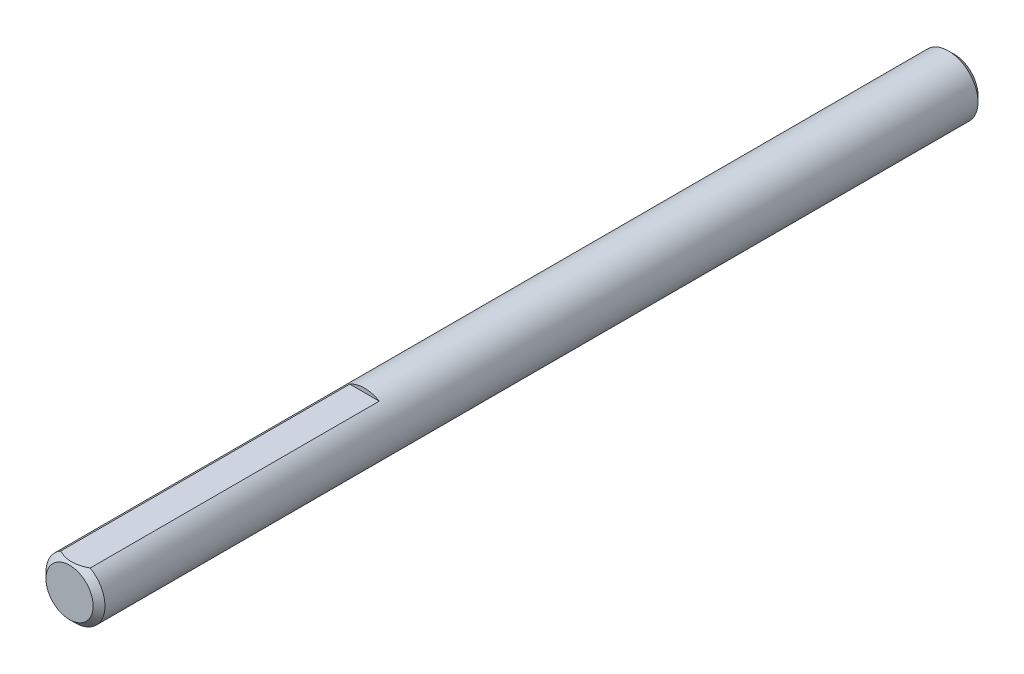
ISO-10303-21;
HEADER;
FILE_DESCRIPTION(('STEP AP214'),'2;1');
FILE_NAME('part.step','',(''),(''),'','','');
FILE_SCHEMA(('AUTOMOTIVE_DESIGN { 1 0 10303 214 1 1 1 1 }'));
ENDSEC;
DATA;
#1=APPLICATION_CONTEXT('core data for automotive mechanical design processes');
#2=APPLICATION_PROTOCOL_DEFINITION('international standard','automotive_design',2000,#1);
#3=PRODUCT_CONTEXT('',#1,'mechanical');
#4=PRODUCT('Part','Part','',(#3));
#5=PRODUCT_RELATED_PRODUCT_CATEGORY('part','',(#4));
#6=PRODUCT_DEFINITION_FORMATION('','',#4);
#7=PRODUCT_DEFINITION_CONTEXT('part definition',#1,'design');
#8=PRODUCT_DEFINITION('design','',#6,#7);
#9=PRODUCT_DEFINITION_SHAPE('','',#8);
#10=(LENGTH_UNIT() NAMED_UNIT(*) SI_UNIT(.MILLI.,.METRE.));
#11=(NAMED_UNIT(*) PLANE_ANGLE_UNIT() SI_UNIT($,.RADIAN.));
#12=(NAMED_UNIT(*) SI_UNIT($,.STERADIAN.) SOLID_ANGLE_UNIT());
#13=UNCERTAINTY_MEASURE_WITH_UNIT(LENGTH_MEASURE(1.E-05),#10,'distance_accuracy_value','');
#14=(GEOMETRIC_REPRESENTATION_CONTEXT(3) GLOBAL_UNCERTAINTY_ASSIGNED_CONTEXT((#13)) GLOBAL_UNIT_ASSIGNED_CONTEXT((#10,
#11,#12)) REPRESENTATION_CONTEXT('',''));
#15=CARTESIAN_POINT('',(0.,0.,0.));
#16=DIRECTION('',(0.,0.,1.));
#17=DIRECTION('',(1.,0.,0.));
#18=AXIS2_PLACEMENT_3D('',#15,#16,#17);
#19=CARTESIAN_POINT('',(0.,0.,38.1));
#20=DIRECTION('',(0.,0.,-1.));
#21=DIRECTION('',(-1.,0.,0.));
#22=AXIS2_PLACEMENT_3D('',#19,#20,#21);
#23=CYLINDRICAL_SURFACE('',#22,2.54);
#24=CARTESIAN_POINT('',(0.,0.,-37.5919999999999));
#25=DIRECTION('',(0.,0.,1.));
#26=DIRECTION('',(1.,0.,0.));
#27=AXIS2_PLACEMENT_3D('',#24,#25,#26);
#28=CIRCLE('',#27,2.54);
#29=CARTESIAN_POINT('',(2.54,0.,-37.5919999999999));
#30=VERTEX_POINT('',#29);
#31=EDGE_CURVE('E77',#30,#30,#28,.T.);
#32=ORIENTED_EDGE('',*,*,#31,.T.);
#33=EDGE_LOOP('',(#32));
#34=FACE_BOUND('',#33,.T.);
#35=DIRECTION('',(0.,0.,-1.));
#36=VECTOR('',#35,1.);
#37=CARTESIAN_POINT('',(1.27,2.19970452561247,38.1));
#38=LINE('',#37,#36);
#39=CARTESIAN_POINT('',(1.27,2.19970452561247,37.592));
#40=VERTEX_POINT('',#39);
#41=CARTESIAN_POINT('',(1.27,2.19970452561247,12.7));
#42=VERTEX_POINT('',#41);
#43=EDGE_CURVE('E65',#40,#42,#38,.T.);
#44=ORIENTED_EDGE('',*,*,#43,.F.);
#45=CARTESIAN_POINT('',(0.,0.,37.592));
#46=DIRECTION('',(0.,0.,1.));
#47=DIRECTION('',(1.,0.,0.));
#48=AXIS2_PLACEMENT_3D('',#45,#46,#47);
#49=CIRCLE('',#48,2.54);
#50=CARTESIAN_POINT('',(-1.27,2.19970452561247,37.592));
#51=VERTEX_POINT('',#50);
#52=EDGE_CURVE('E75',#40,#51,#49,.F.);
#53=ORIENTED_EDGE('',*,*,#52,.T.);
#54=DIRECTION('',(0.,0.,-1.));
#55=VECTOR('',#54,1.);
#56=CARTESIAN_POINT('',(-1.27,2.19970452561247,38.1));
#57=LINE('',#56,#55);
#58=CARTESIAN_POINT('',(-1.27,2.19970452561247,12.7));
#59=VERTEX_POINT('',#58);
#60=EDGE_CURVE('E54',#51,#59,#57,.T.);
#61=ORIENTED_EDGE('',*,*,#60,.T.);
#62=CARTESIAN_POINT('',(0.,0.,12.7));
#63=DIRECTION('',(0.,0.,1.));
#64=DIRECTION('',(1.,0.,0.));
#65=AXIS2_PLACEMENT_3D('',#62,#63,#64);
#66=CIRCLE('',#65,2.54);
#67=EDGE_CURVE('E68',#42,#59,#66,.T.);
#68=ORIENTED_EDGE('',*,*,#67,.F.);
#69=EDGE_LOOP('',(#44,#53,#61,#68));
#70=FACE_BOUND('',#69,.T.);
#71=ADVANCED_FACE('F33',(#34,#70),#23,.T.);
#72=CARTESIAN_POINT('',(0.,0.,38.1));
#73=DIRECTION('',(0.,0.,-1.));
#74=DIRECTION('',(-1.,0.,0.));
#75=AXIS2_PLACEMENT_3D('',#72,#73,#74);
#76=CONICAL_SURFACE('',#75,2.03200000000003,0.785398163397448);
#77=CARTESIAN_POINT('',(0.,0.,38.1));
#78=DIRECTION('',(0.,0.,1.));
#79=DIRECTION('',(1.,0.,0.));
#80=AXIS2_PLACEMENT_3D('',#77,#78,#79);
#81=CIRCLE('',#80,2.03200000000003);
#82=CARTESIAN_POINT('',(2.03200000000003,0.,38.1));
#83=VERTEX_POINT('',#82);
#84=EDGE_CURVE('E47',#83,#83,#81,.T.);
#85=ORIENTED_EDGE('',*,*,#84,.F.);
#86=EDGE_LOOP('',(#85));
#87=FACE_BOUND('',#86,.T.);
#88=ORIENTED_EDGE('',*,*,#52,.F.);
#89=CARTESIAN_POINT('',(-2.58316908178985,2.19970452561247,36.739145375187));
#90=CARTESIAN_POINT('',(-2.52049319640085,2.19970452561247,36.7868532196368));
#91=CARTESIAN_POINT('',(-2.45747207721012,2.19970452561247,36.83411478562));
#92=CARTESIAN_POINT('',(-2.33060104455056,2.19970452561247,36.9275437740947));
#93=CARTESIAN_POINT('',(-2.26675093205037,2.19970452561247,36.9737109260207));
#94=CARTESIAN_POINT('',(-2.13761650282198,2.19970452561247,37.0650780382441));
#95=CARTESIAN_POINT('',(-2.07232491176344,2.19970452561247,37.1102677516298));
#96=CARTESIAN_POINT('',(-1.94064249297732,2.19970452561247,37.1990108114676));
#97=CARTESIAN_POINT('',(-1.87425174247469,2.19970452561247,37.2425642721828));
#98=CARTESIAN_POINT('',(-1.73617158229784,2.19970452561247,37.3302190969326));
#99=CARTESIAN_POINT('',(-1.66440318819355,2.19970452561247,37.3741966682722));
#100=CARTESIAN_POINT('',(-1.51920723742954,2.19970452561247,37.4593175945583));
#101=CARTESIAN_POINT('',(-1.44577990020509,2.19970452561247,37.5004613214679));
#102=CARTESIAN_POINT('',(-1.29723008295145,2.19970452561247,37.5790518440412));
#103=CARTESIAN_POINT('',(-1.22211312737996,2.19970452561247,37.6165090001414));
#104=CARTESIAN_POINT('',(-1.06979765257681,2.19970452561247,37.6868806522726));
#105=CARTESIAN_POINT('',(-0.992600112901668,2.19970452561247,37.7197972428754));
#106=CARTESIAN_POINT('',(-0.842917942085993,2.19970452561247,37.7772451497844));
#107=CARTESIAN_POINT('',(-0.770621140470917,2.19970452561247,37.8022608351786));
#108=CARTESIAN_POINT('',(-0.624242988128888,2.19970452561247,37.8464985498804));
#109=CARTESIAN_POINT('',(-0.550161519023574,2.19970452561247,37.8657201937157));
#110=CARTESIAN_POINT('',(-0.401913145026286,2.19970452561247,37.8970306326729));
#111=CARTESIAN_POINT('',(-0.327773156117409,2.19970452561247,37.9092447637992));
#112=CARTESIAN_POINT('',(-0.178645064548218,2.19970452561247,37.9262950736235));
#113=CARTESIAN_POINT('',(-0.1036571227499,2.19970452561247,37.9311326288113));
#114=CARTESIAN_POINT('',(0.0434686047213363,2.19970452561247,37.9330475881988));
#115=CARTESIAN_POINT('',(0.115602594041888,2.19970452561247,37.9304224689823));
#116=CARTESIAN_POINT('',(0.259276434858723,2.19970452561247,37.9182254175711));
#117=CARTESIAN_POINT('',(0.330816229517487,2.19970452561247,37.9086528283852));
#118=CARTESIAN_POINT('',(0.473996852819252,2.19970452561247,37.8829292188289));
#119=CARTESIAN_POINT('',(0.545616941903209,2.19970452561247,37.8666644641402));
#120=CARTESIAN_POINT('',(0.687282699171054,2.19970452561247,37.8284361583632));
#121=CARTESIAN_POINT('',(0.757328480871022,2.19970452561247,37.8064730196011));
#122=CARTESIAN_POINT('',(0.9756369814437,2.19970452561247,37.7297035857518));
#123=CARTESIAN_POINT('',(1.12086875210132,2.19970452561247,37.6662475621891));
#124=CARTESIAN_POINT('',(1.33340711591887,2.19970452561247,37.5604431881806));
#125=CARTESIAN_POINT('',(1.40349990708013,2.19970452561247,37.5233221288991));
#126=CARTESIAN_POINT('',(1.5420956117248,2.19970452561247,37.4462153902142));
#127=CARTESIAN_POINT('',(1.61059880564365,2.19970452561247,37.4062302212605));
#128=CARTESIAN_POINT('',(1.74284147428589,2.19970452561247,37.3260110746449));
#129=CARTESIAN_POINT('',(1.80664877799041,2.19970452561247,37.2858876472317));
#130=CARTESIAN_POINT('',(1.93316894911998,2.19970452561247,37.2039425742101));
#131=CARTESIAN_POINT('',(1.99588173350543,2.19970452561247,37.1621208005445));
#132=CARTESIAN_POINT('',(2.11984789806904,2.19970452561247,37.0774265000444));
#133=CARTESIAN_POINT('',(2.18110897587168,2.19970452561247,37.0345651934191));
#134=CARTESIAN_POINT('',(2.30279235975335,2.19970452561247,36.9477016720136));
#135=CARTESIAN_POINT('',(2.3632148921541,2.19970452561247,36.9036997746473));
#136=CARTESIAN_POINT('',(2.423286167757,2.19970452561247,36.8592311644661));
#137=B_SPLINE_CURVE_WITH_KNOTS('',3,(#89,#90,#91,#92,#93,#94,#95,#96,#97,#98,#99,#100,#101,#102,
#103,#104,#105,#106,#107,#108,#109,#110,#111,#112,#113,#114,#115,#116,#117,#118,#119,#120,#121,
#122,#123,#124,#125,#126,#127,#128,#129,#130,#131,#132,#133,#134,#135,#136),.UNSPECIFIED.,.F.,
.F.,(4,2,2,2,2,2,2,2,2,2,2,2,2,2,2,2,2,2,2,2,2,2,2,4),(0.,0.236306759416962,0.472671342799029,
0.710864697298355,0.949041387192554,1.20150228455804,1.45392998115477,1.70562670635857,
1.95720693227341,2.18651411751708,2.41583655499066,2.640918066093,2.86595757121621,
3.08215381034795,3.2983704968575,3.51842444483518,3.73846247449497,4.2124565699305,
4.45038398784305,4.68826910666773,4.91436418872703,5.14047635037539,5.36476156104095,
5.58898501181812),.UNSPECIFIED.);
#138=EDGE_CURVE('E11',#40,#51,#137,.F.);
#139=ORIENTED_EDGE('',*,*,#138,.T.);
#140=EDGE_LOOP('',(#88,#139));
#141=FACE_BOUND('',#140,.T.);
#142=ADVANCED_FACE('F35',(#87,#141),#76,.T.);
#143=CARTESIAN_POINT('',(0.,0.,38.1));
#144=DIRECTION('',(0.,0.,1.));
#145=DIRECTION('',(1.,0.,0.));
#146=AXIS2_PLACEMENT_3D('',#143,#144,#145);
#147=PLANE('',#146);
#148=ORIENTED_EDGE('',*,*,#84,.T.);
#149=EDGE_LOOP('',(#148));
#150=FACE_BOUND('',#149,.T.);
#151=ADVANCED_FACE('F88',(#150),#147,.T.);
#152=CARTESIAN_POINT('',(0.,0.,-38.1));
#153=DIRECTION('',(0.,0.,1.));
#154=DIRECTION('',(1.,0.,0.));
#155=AXIS2_PLACEMENT_3D('',#152,#153,#154);
#156=PLANE('',#155);
#157=CARTESIAN_POINT('',(0.,0.,-38.1));
#158=DIRECTION('',(0.,0.,1.));
#159=DIRECTION('',(1.,0.,0.));
#160=AXIS2_PLACEMENT_3D('',#157,#158,#159);
#161=CIRCLE('',#160,2.03199999999993);
#162=CARTESIAN_POINT('',(2.03199999999993,0.,-38.1));
#163=VERTEX_POINT('',#162);
#164=EDGE_CURVE('E83',#163,#163,#161,.F.);
#165=ORIENTED_EDGE('',*,*,#164,.T.);
#166=EDGE_LOOP('',(#165));
#167=FACE_BOUND('',#166,.T.);
#168=ADVANCED_FACE('F96',(#167),#156,.F.);
#169=CARTESIAN_POINT('',(0.,0.,-37.5919999999999));
#170=DIRECTION('',(0.,0.,1.));
#171=DIRECTION('',(1.,0.,0.));
#172=AXIS2_PLACEMENT_3D('',#169,#170,#171);
#173=CONICAL_SURFACE('',#172,2.54,0.785398163397442);
#174=ORIENTED_EDGE('',*,*,#164,.F.);
#175=EDGE_LOOP('',(#174));
#176=FACE_BOUND('',#175,.T.);
#177=ORIENTED_EDGE('',*,*,#31,.F.);
#178=EDGE_LOOP('',(#177));
#179=FACE_BOUND('',#178,.T.);
#180=ADVANCED_FACE('F103',(#176,#179),#173,.T.);
#181=CARTESIAN_POINT('',(-1.27,2.19970452561247,38.1));
#182=DIRECTION('',(0.,1.,0.));
#183=DIRECTION('',(0.,0.,1.));
#184=AXIS2_PLACEMENT_3D('',#181,#182,#183);
#185=PLANE('',#184);
#186=ORIENTED_EDGE('',*,*,#43,.T.);
#187=DIRECTION('',(1.,0.,0.));
#188=VECTOR('',#187,1.);
#189=CARTESIAN_POINT('',(-1.27,2.19970452561247,12.7));
#190=LINE('',#189,#188);
#191=EDGE_CURVE('E62',#59,#42,#190,.T.);
#192=ORIENTED_EDGE('',*,*,#191,.F.);
#193=ORIENTED_EDGE('',*,*,#60,.F.);
#194=ORIENTED_EDGE('',*,*,#138,.F.);
#195=EDGE_LOOP('',(#186,#192,#193,#194));
#196=FACE_BOUND('',#195,.T.);
#197=ADVANCED_FACE('F64',(#196),#185,.T.);
#198=CARTESIAN_POINT('',(0.,0.,12.7));
#199=DIRECTION('',(0.,0.,1.));
#200=DIRECTION('',(1.,0.,0.));
#201=AXIS2_PLACEMENT_3D('',#198,#199,#200);
#202=PLANE('',#201);
#203=ORIENTED_EDGE('',*,*,#67,.T.);
#204=ORIENTED_EDGE('',*,*,#191,.T.);
#205=EDGE_LOOP('',(#203,#204));
#206=FACE_BOUND('',#205,.T.);
#207=ADVANCED_FACE('F70',(#206),#202,.T.);
#208=CLOSED_SHELL('',(#71,#142,#151,#168,#180,#197,#207));
#209=MANIFOLD_SOLID_BREP('B2',#208);
#210=ADVANCED_BREP_SHAPE_REPRESENTATION('',(#18,#209),#14);
#211=SHAPE_DEFINITION_REPRESENTATION(#9,#210);
ENDSEC;
END-ISO-10303-21;
